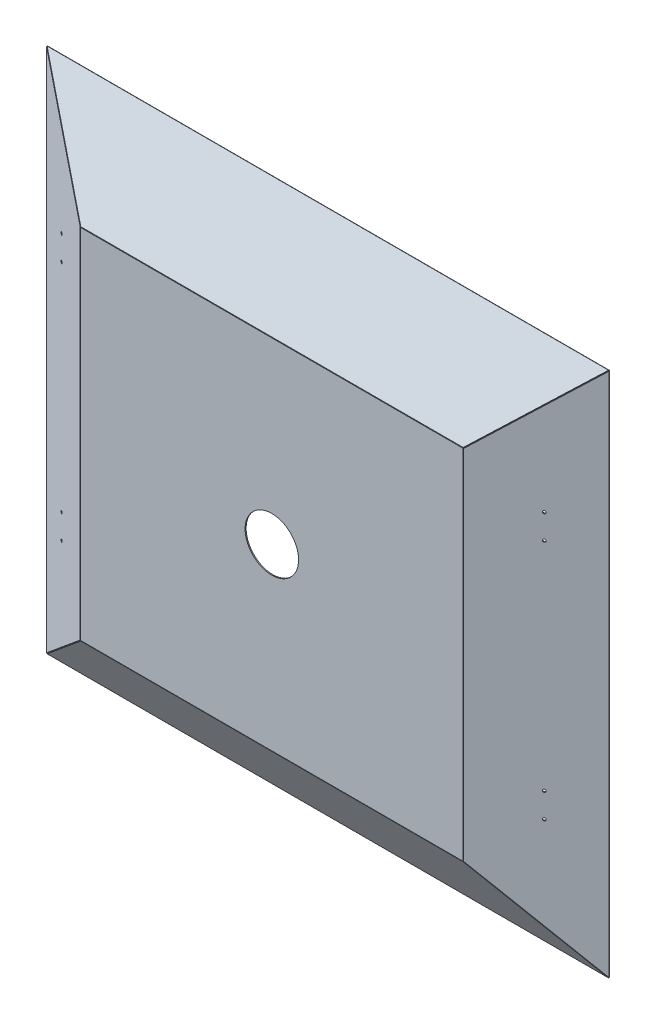
ISO-10303-21;
HEADER;
FILE_DESCRIPTION(('STEP AP214'),'2;1');
FILE_NAME('part.step','',(''),(''),'','','');
FILE_SCHEMA(('AUTOMOTIVE_DESIGN { 1 0 10303 214 1 1 1 1 }'));
ENDSEC;
DATA;
#1=APPLICATION_CONTEXT('core data for automotive mechanical design processes');
#2=APPLICATION_PROTOCOL_DEFINITION('international standard','automotive_design',2000,#1);
#3=PRODUCT_CONTEXT('',#1,'mechanical');
#4=PRODUCT('Part','Part','',(#3));
#5=PRODUCT_RELATED_PRODUCT_CATEGORY('part','',(#4));
#6=PRODUCT_DEFINITION_FORMATION('','',#4);
#7=PRODUCT_DEFINITION_CONTEXT('part definition',#1,'design');
#8=PRODUCT_DEFINITION('design','',#6,#7);
#9=PRODUCT_DEFINITION_SHAPE('','',#8);
#10=(LENGTH_UNIT() NAMED_UNIT(*) SI_UNIT(.MILLI.,.METRE.));
#11=(NAMED_UNIT(*) PLANE_ANGLE_UNIT() SI_UNIT($,.RADIAN.));
#12=(NAMED_UNIT(*) SI_UNIT($,.STERADIAN.) SOLID_ANGLE_UNIT());
#13=UNCERTAINTY_MEASURE_WITH_UNIT(LENGTH_MEASURE(1.E-05),#10,'distance_accuracy_value','');
#14=(GEOMETRIC_REPRESENTATION_CONTEXT(3) GLOBAL_UNCERTAINTY_ASSIGNED_CONTEXT((#13)) GLOBAL_UNIT_ASSIGNED_CONTEXT((#10,
#11,#12)) REPRESENTATION_CONTEXT('',''));
#15=CARTESIAN_POINT('',(0.,0.,0.));
#16=DIRECTION('',(0.,0.,1.));
#17=DIRECTION('',(1.,0.,0.));
#18=AXIS2_PLACEMENT_3D('',#15,#16,#17);
#19=CARTESIAN_POINT('',(-550.624060150376,-515.,103.));
#20=DIRECTION('',(1.,0.,0.));
#21=DIRECTION('',(0.,0.,-1.));
#22=AXIS2_PLACEMENT_3D('',#19,#20,#21);
#23=PLANE('',#22);
#24=DIRECTION('',(0.,-1.,0.));
#25=VECTOR('',#24,1.);
#26=CARTESIAN_POINT('',(-550.624060150376,-515.,100.));
#27=LINE('',#26,#25);
#28=CARTESIAN_POINT('',(-550.624060150376,515.,100.));
#29=VERTEX_POINT('',#28);
#30=CARTESIAN_POINT('',(-550.624060150376,-515.,100.));
#31=VERTEX_POINT('',#30);
#32=EDGE_CURVE('E118',#29,#31,#27,.T.);
#33=ORIENTED_EDGE('',*,*,#32,.T.);
#34=DIRECTION('',(0.,0.,-1.));
#35=VECTOR('',#34,1.);
#36=CARTESIAN_POINT('',(-550.624060150376,-515.,103.));
#37=LINE('',#36,#35);
#38=CARTESIAN_POINT('',(-550.624060150376,-515.,103.));
#39=VERTEX_POINT('',#38);
#40=EDGE_CURVE('E12',#39,#31,#37,.T.);
#41=ORIENTED_EDGE('',*,*,#40,.F.);
#42=DIRECTION('',(0.,-1.,0.));
#43=VECTOR('',#42,1.);
#44=CARTESIAN_POINT('',(-550.624060150376,-515.,103.));
#45=LINE('',#44,#43);
#46=CARTESIAN_POINT('',(-550.624060150376,515.,103.));
#47=VERTEX_POINT('',#46);
#48=EDGE_CURVE('E105',#47,#39,#45,.T.);
#49=ORIENTED_EDGE('',*,*,#48,.F.);
#50=DIRECTION('',(0.,0.,-1.));
#51=VECTOR('',#50,1.);
#52=CARTESIAN_POINT('',(-550.624060150376,515.,103.));
#53=LINE('',#52,#51);
#54=EDGE_CURVE('E114',#47,#29,#53,.T.);
#55=ORIENTED_EDGE('',*,*,#54,.T.);
#56=EDGE_LOOP('',(#33,#41,#49,#55));
#57=FACE_BOUND('',#56,.T.);
#58=ADVANCED_FACE('F53',(#57),#23,.F.);
#59=CARTESIAN_POINT('',(-550.624060150376,-515.,103.));
#60=DIRECTION('',(0.,1.,0.));
#61=DIRECTION('',(0.,0.,1.));
#62=AXIS2_PLACEMENT_3D('',#59,#60,#61);
#63=PLANE('',#62);
#64=DIRECTION('',(1.,0.,0.));
#65=VECTOR('',#64,1.);
#66=CARTESIAN_POINT('',(-550.624060150376,-515.,100.));
#67=LINE('',#66,#65);
#68=CARTESIAN_POINT('',(550.624060150375,-515.,100.));
#69=VERTEX_POINT('',#68);
#70=EDGE_CURVE('E109',#31,#69,#67,.T.);
#71=ORIENTED_EDGE('',*,*,#70,.T.);
#72=DIRECTION('',(0.,0.,-1.));
#73=VECTOR('',#72,1.);
#74=CARTESIAN_POINT('',(550.624060150375,-515.,103.));
#75=LINE('',#74,#73);
#76=CARTESIAN_POINT('',(550.624060150375,-515.,103.));
#77=VERTEX_POINT('',#76);
#78=EDGE_CURVE('E62',#77,#69,#75,.T.);
#79=ORIENTED_EDGE('',*,*,#78,.F.);
#80=DIRECTION('',(1.,0.,0.));
#81=VECTOR('',#80,1.);
#82=CARTESIAN_POINT('',(-550.624060150376,-515.,103.));
#83=LINE('',#82,#81);
#84=EDGE_CURVE('E100',#39,#77,#83,.T.);
#85=ORIENTED_EDGE('',*,*,#84,.F.);
#86=ORIENTED_EDGE('',*,*,#40,.T.);
#87=EDGE_LOOP('',(#71,#79,#85,#86));
#88=FACE_BOUND('',#87,.T.);
#89=ADVANCED_FACE('F108',(#88),#63,.F.);
#90=CARTESIAN_POINT('',(550.624060150375,-515.,103.));
#91=DIRECTION('',(-1.,0.,0.));
#92=DIRECTION('',(0.,0.,1.));
#93=AXIS2_PLACEMENT_3D('',#90,#91,#92);
#94=PLANE('',#93);
#95=DIRECTION('',(0.,1.,0.));
#96=VECTOR('',#95,1.);
#97=CARTESIAN_POINT('',(550.624060150375,-515.,100.));
#98=LINE('',#97,#96);
#99=CARTESIAN_POINT('',(550.624060150375,515.,100.));
#100=VERTEX_POINT('',#99);
#101=EDGE_CURVE('E87',#69,#100,#98,.T.);
#102=ORIENTED_EDGE('',*,*,#101,.T.);
#103=DIRECTION('',(0.,0.,-1.));
#104=VECTOR('',#103,1.);
#105=CARTESIAN_POINT('',(550.624060150375,515.,103.));
#106=LINE('',#105,#104);
#107=CARTESIAN_POINT('',(550.624060150375,515.,103.));
#108=VERTEX_POINT('',#107);
#109=EDGE_CURVE('E110',#108,#100,#106,.T.);
#110=ORIENTED_EDGE('',*,*,#109,.F.);
#111=DIRECTION('',(0.,1.,0.));
#112=VECTOR('',#111,1.);
#113=CARTESIAN_POINT('',(550.624060150375,-515.,103.));
#114=LINE('',#113,#112);
#115=EDGE_CURVE('E103',#77,#108,#114,.T.);
#116=ORIENTED_EDGE('',*,*,#115,.F.);
#117=ORIENTED_EDGE('',*,*,#78,.T.);
#118=EDGE_LOOP('',(#102,#110,#116,#117));
#119=FACE_BOUND('',#118,.T.);
#120=ADVANCED_FACE('F112',(#119),#94,.F.);
#121=CARTESIAN_POINT('',(-550.624060150376,515.,103.));
#122=DIRECTION('',(0.,-1.,0.));
#123=DIRECTION('',(0.,0.,-1.));
#124=AXIS2_PLACEMENT_3D('',#121,#122,#123);
#125=PLANE('',#124);
#126=DIRECTION('',(-1.,0.,0.));
#127=VECTOR('',#126,1.);
#128=CARTESIAN_POINT('',(-550.624060150376,515.,100.));
#129=LINE('',#128,#127);
#130=EDGE_CURVE('E93',#100,#29,#129,.T.);
#131=ORIENTED_EDGE('',*,*,#130,.T.);
#132=ORIENTED_EDGE('',*,*,#54,.F.);
#133=DIRECTION('',(-1.,0.,0.));
#134=VECTOR('',#133,1.);
#135=CARTESIAN_POINT('',(-550.624060150376,515.,103.));
#136=LINE('',#135,#134);
#137=EDGE_CURVE('E70',#108,#47,#136,.T.);
#138=ORIENTED_EDGE('',*,*,#137,.F.);
#139=ORIENTED_EDGE('',*,*,#109,.T.);
#140=EDGE_LOOP('',(#131,#132,#138,#139));
#141=FACE_BOUND('',#140,.T.);
#142=ADVANCED_FACE('F125',(#141),#125,.F.);
#143=CARTESIAN_POINT('',(0.,0.,103.));
#144=DIRECTION('',(0.,0.,-1.));
#145=DIRECTION('',(-1.,0.,0.));
#146=AXIS2_PLACEMENT_3D('',#143,#144,#145);
#147=PLANE('',#146);
#148=CARTESIAN_POINT('',(0.,0.,103.));
#149=DIRECTION('',(0.,0.,1.));
#150=DIRECTION('',(1.,0.,0.));
#151=AXIS2_PLACEMENT_3D('',#148,#149,#150);
#152=CIRCLE('',#151,77.);
#153=CARTESIAN_POINT('',(77.,0.,103.));
#154=VERTEX_POINT('',#153);
#155=EDGE_CURVE('E131',#154,#154,#152,.T.);
#156=ORIENTED_EDGE('',*,*,#155,.F.);
#157=EDGE_LOOP('',(#156));
#158=FACE_BOUND('',#157,.T.);
#159=ORIENTED_EDGE('',*,*,#48,.T.);
#160=ORIENTED_EDGE('',*,*,#84,.T.);
#161=ORIENTED_EDGE('',*,*,#115,.T.);
#162=ORIENTED_EDGE('',*,*,#137,.T.);
#163=EDGE_LOOP('',(#159,#160,#161,#162));
#164=FACE_BOUND('',#163,.T.);
#165=ADVANCED_FACE('F101',(#158,#164),#147,.F.);
#166=CARTESIAN_POINT('',(0.,0.,100.));
#167=DIRECTION('',(0.,0.,-1.));
#168=DIRECTION('',(-1.,0.,0.));
#169=AXIS2_PLACEMENT_3D('',#166,#167,#168);
#170=PLANE('',#169);
#171=CARTESIAN_POINT('',(0.,0.,100.));
#172=DIRECTION('',(0.,0.,-1.));
#173=DIRECTION('',(-1.,0.,0.));
#174=AXIS2_PLACEMENT_3D('',#171,#172,#173);
#175=CIRCLE('',#174,77.);
#176=CARTESIAN_POINT('',(-77.,0.,100.));
#177=VERTEX_POINT('',#176);
#178=EDGE_CURVE('E56',#177,#177,#175,.T.);
#179=ORIENTED_EDGE('',*,*,#178,.F.);
#180=EDGE_LOOP('',(#179));
#181=FACE_BOUND('',#180,.T.);
#182=ORIENTED_EDGE('',*,*,#32,.F.);
#183=ORIENTED_EDGE('',*,*,#130,.F.);
#184=ORIENTED_EDGE('',*,*,#101,.F.);
#185=ORIENTED_EDGE('',*,*,#70,.F.);
#186=EDGE_LOOP('',(#182,#183,#184,#185));
#187=FACE_BOUND('',#186,.T.);
#188=ADVANCED_FACE('F128',(#181,#187),#170,.T.);
#189=CARTESIAN_POINT('',(0.,0.,-60.8630569053166));
#190=DIRECTION('',(0.,0.,1.));
#191=DIRECTION('',(1.,0.,0.));
#192=AXIS2_PLACEMENT_3D('',#189,#190,#191);
#193=CYLINDRICAL_SURFACE('',#192,77.);
#194=ORIENTED_EDGE('',*,*,#178,.T.);
#195=EDGE_LOOP('',(#194));
#196=FACE_BOUND('',#195,.T.);
#197=ORIENTED_EDGE('',*,*,#155,.T.);
#198=EDGE_LOOP('',(#197));
#199=FACE_BOUND('',#198,.T.);
#200=ADVANCED_FACE('F138',(#196,#199),#193,.F.);
#201=CLOSED_SHELL('',(#58,#89,#120,#142,#165,#188,#200));
#202=MANIFOLD_SOLID_BREP('B2',#201);
#203=CARTESIAN_POINT('',(808.609699533113,757.95868594665,-58.3669060223027));
#204=DIRECTION('',(0.74714334267065,-0.55303299592244,0.368688663948294));
#205=DIRECTION('',(0.594945131002593,0.803766316224005,0.));
#206=AXIS2_PLACEMENT_3D('',#203,#204,#205);
#207=PLANE('',#206);
#208=DIRECTION('',(-0.664662941273942,-0.621660838181675,0.414440558787783));
#209=VECTOR('',#208,1.);
#210=CARTESIAN_POINT('',(808.609699533113,756.294585357975,-60.8630569053162));
#211=LINE('',#210,#209);
#212=CARTESIAN_POINT('',(808.609699533113,756.294585357975,-60.8630569053162));
#213=VERTEX_POINT('',#212);
#214=CARTESIAN_POINT('',(550.624060150375,515.,100.));
#215=VERTEX_POINT('',#214);
#216=EDGE_CURVE('E271',#213,#215,#211,.T.);
#217=ORIENTED_EDGE('',*,*,#216,.F.);
#218=DIRECTION('',(0.,-0.554700196225229,-0.832050294337844));
#219=VECTOR('',#218,1.);
#220=CARTESIAN_POINT('',(808.609699533113,757.95868594665,-58.3669060223027));
#221=LINE('',#220,#219);
#222=CARTESIAN_POINT('',(808.609699533113,757.95868594665,-58.3669060223027));
#223=VERTEX_POINT('',#222);
#224=EDGE_CURVE('E51',#223,#213,#221,.T.);
#225=ORIENTED_EDGE('',*,*,#224,.F.);
#226=DIRECTION('',(-0.664662941273942,-0.621660838181675,0.414440558787783));
#227=VECTOR('',#226,1.);
#228=CARTESIAN_POINT('',(808.609699533113,757.95868594665,-58.3669060223027));
#229=LINE('',#228,#227);
#230=CARTESIAN_POINT('',(550.624060150375,516.664100588676,102.496150883014));
#231=VERTEX_POINT('',#230);
#232=EDGE_CURVE('E265',#223,#231,#229,.T.);
#233=ORIENTED_EDGE('',*,*,#232,.T.);
#234=DIRECTION('',(0.,-0.554700196225229,-0.832050294337844));
#235=VECTOR('',#234,1.);
#236=CARTESIAN_POINT('',(550.624060150375,516.664100588676,102.496150883014));
#237=LINE('',#236,#235);
#238=EDGE_CURVE('E210',#231,#215,#237,.T.);
#239=ORIENTED_EDGE('',*,*,#238,.T.);
#240=EDGE_LOOP('',(#217,#225,#233,#239));
#241=FACE_BOUND('',#240,.T.);
#242=ADVANCED_FACE('F207',(#241),#207,.T.);
#243=CARTESIAN_POINT('',(-808.609699533113,757.95868594665,-58.3669060223028));
#244=DIRECTION('',(0.,0.832050294337844,-0.554700196225229));
#245=DIRECTION('',(0.,0.554700196225229,0.832050294337844));
#246=AXIS2_PLACEMENT_3D('',#243,#244,#245);
#247=PLANE('',#246);
#248=DIRECTION('',(1.,0.,0.));
#249=VECTOR('',#248,1.);
#250=CARTESIAN_POINT('',(-808.609699533113,756.294585357975,-60.8630569053163));
#251=LINE('',#250,#249);
#252=CARTESIAN_POINT('',(-808.609699533113,756.294585357975,-60.8630569053163));
#253=VERTEX_POINT('',#252);
#254=EDGE_CURVE('E267',#253,#213,#251,.T.);
#255=ORIENTED_EDGE('',*,*,#254,.F.);
#256=DIRECTION('',(0.,-0.554700196225229,-0.832050294337844));
#257=VECTOR('',#256,1.);
#258=CARTESIAN_POINT('',(-808.609699533113,757.95868594665,-58.3669060223028));
#259=LINE('',#258,#257);
#260=CARTESIAN_POINT('',(-808.609699533113,757.95868594665,-58.3669060223028));
#261=VERTEX_POINT('',#260);
#262=EDGE_CURVE('E216',#261,#253,#259,.T.);
#263=ORIENTED_EDGE('',*,*,#262,.F.);
#264=DIRECTION('',(1.,0.,0.));
#265=VECTOR('',#264,1.);
#266=CARTESIAN_POINT('',(-808.609699533113,757.95868594665,-58.3669060223028));
#267=LINE('',#266,#265);
#268=EDGE_CURVE('E262',#261,#223,#267,.T.);
#269=ORIENTED_EDGE('',*,*,#268,.T.);
#270=ORIENTED_EDGE('',*,*,#224,.T.);
#271=EDGE_LOOP('',(#255,#263,#269,#270));
#272=FACE_BOUND('',#271,.T.);
#273=ADVANCED_FACE('F281',(#272),#247,.T.);
#274=CARTESIAN_POINT('',(-550.624060150376,516.664100588676,102.496150883014));
#275=DIRECTION('',(-0.74714334267065,-0.55303299592244,0.368688663948293));
#276=DIRECTION('',(0.594945131002593,-0.803766316224005,0.));
#277=AXIS2_PLACEMENT_3D('',#274,#275,#276);
#278=PLANE('',#277);
#279=DIRECTION('',(-0.664662941273942,0.621660838181675,-0.414440558787783));
#280=VECTOR('',#279,1.);
#281=CARTESIAN_POINT('',(-550.624060150376,515.,100.));
#282=LINE('',#281,#280);
#283=CARTESIAN_POINT('',(-550.624060150376,515.,100.));
#284=VERTEX_POINT('',#283);
#285=EDGE_CURVE('E257',#284,#253,#282,.T.);
#286=ORIENTED_EDGE('',*,*,#285,.F.);
#287=DIRECTION('',(0.,-0.554700196225229,-0.832050294337844));
#288=VECTOR('',#287,1.);
#289=CARTESIAN_POINT('',(-550.624060150376,516.664100588676,102.496150883014));
#290=LINE('',#289,#288);
#291=CARTESIAN_POINT('',(-550.624060150376,516.664100588676,102.496150883014));
#292=VERTEX_POINT('',#291);
#293=EDGE_CURVE('E252',#292,#284,#290,.T.);
#294=ORIENTED_EDGE('',*,*,#293,.F.);
#295=DIRECTION('',(-0.664662941273942,0.621660838181675,-0.414440558787783));
#296=VECTOR('',#295,1.);
#297=CARTESIAN_POINT('',(-550.624060150376,516.664100588676,102.496150883014));
#298=LINE('',#297,#296);
#299=EDGE_CURVE('E255',#292,#261,#298,.T.);
#300=ORIENTED_EDGE('',*,*,#299,.T.);
#301=ORIENTED_EDGE('',*,*,#262,.T.);
#302=EDGE_LOOP('',(#286,#294,#300,#301));
#303=FACE_BOUND('',#302,.T.);
#304=ADVANCED_FACE('F254',(#303),#278,.T.);
#305=CARTESIAN_POINT('',(550.624060150375,516.664100588676,102.496150883014));
#306=DIRECTION('',(0.,-0.832050294337844,0.554700196225229));
#307=DIRECTION('',(0.,-0.554700196225229,-0.832050294337844));
#308=AXIS2_PLACEMENT_3D('',#305,#306,#307);
#309=PLANE('',#308);
#310=DIRECTION('',(-1.,0.,0.));
#311=VECTOR('',#310,1.);
#312=CARTESIAN_POINT('',(550.624060150375,515.,100.));
#313=LINE('',#312,#311);
#314=EDGE_CURVE('E274',#215,#284,#313,.T.);
#315=ORIENTED_EDGE('',*,*,#314,.F.);
#316=ORIENTED_EDGE('',*,*,#238,.F.);
#317=DIRECTION('',(-1.,0.,0.));
#318=VECTOR('',#317,1.);
#319=CARTESIAN_POINT('',(550.624060150375,516.664100588676,102.496150883014));
#320=LINE('',#319,#318);
#321=EDGE_CURVE('E261',#231,#292,#320,.T.);
#322=ORIENTED_EDGE('',*,*,#321,.T.);
#323=ORIENTED_EDGE('',*,*,#293,.T.);
#324=EDGE_LOOP('',(#315,#316,#322,#323));
#325=FACE_BOUND('',#324,.T.);
#326=ADVANCED_FACE('F264',(#325),#309,.T.);
#327=CARTESIAN_POINT('',(0.,206.27948520406,309.419227806091));
#328=DIRECTION('',(0.,-0.554700196225229,-0.832050294337844));
#329=DIRECTION('',(0.,0.832050294337844,-0.554700196225229));
#330=AXIS2_PLACEMENT_3D('',#327,#328,#329);
#331=PLANE('',#330);
#332=ORIENTED_EDGE('',*,*,#232,.F.);
#333=ORIENTED_EDGE('',*,*,#268,.F.);
#334=ORIENTED_EDGE('',*,*,#299,.F.);
#335=ORIENTED_EDGE('',*,*,#321,.F.);
#336=EDGE_LOOP('',(#332,#333,#334,#335));
#337=FACE_BOUND('',#336,.T.);
#338=ADVANCED_FACE('F260',(#337),#331,.F.);
#339=CARTESIAN_POINT('',(0.,204.615384615385,306.923076923077));
#340=DIRECTION('',(0.,-0.554700196225229,-0.832050294337844));
#341=DIRECTION('',(0.,0.832050294337844,-0.554700196225229));
#342=AXIS2_PLACEMENT_3D('',#339,#340,#341);
#343=PLANE('',#342);
#344=ORIENTED_EDGE('',*,*,#216,.T.);
#345=ORIENTED_EDGE('',*,*,#314,.T.);
#346=ORIENTED_EDGE('',*,*,#285,.T.);
#347=ORIENTED_EDGE('',*,*,#254,.T.);
#348=EDGE_LOOP('',(#344,#345,#346,#347));
#349=FACE_BOUND('',#348,.T.);
#350=ADVANCED_FACE('F280',(#349),#343,.T.);
#351=CLOSED_SHELL('',(#242,#273,#304,#326,#338,#350));
#352=MANIFOLD_SOLID_BREP('B6',#351);
#353=CARTESIAN_POINT('',(810.197013516392,756.294585357975,-58.3173871862668));
#354=DIRECTION('',(-0.848556573016445,0.,0.529104661093235));
#355=DIRECTION('',(0.529104661093235,0.,0.848556573016445));
#356=AXIS2_PLACEMENT_3D('',#353,#354,#355);
#357=PLANE('',#356);
#358=DIRECTION('',(0.,1.,0.));
#359=VECTOR('',#358,1.);
#360=CARTESIAN_POINT('',(808.609699533113,756.294585357975,-60.8630569053161));
#361=LINE('',#360,#359);
#362=CARTESIAN_POINT('',(808.609699533113,-756.294585357974,-60.8630569053162));
#363=VERTEX_POINT('',#362);
#364=CARTESIAN_POINT('',(808.609699533113,756.294585357975,-60.8630569053161));
#365=VERTEX_POINT('',#364);
#366=EDGE_CURVE('E403',#363,#365,#361,.T.);
#367=ORIENTED_EDGE('',*,*,#366,.T.);
#368=DIRECTION('',(-0.529104661093235,0.,-0.848556573016445));
#369=VECTOR('',#368,1.);
#370=CARTESIAN_POINT('',(810.197013516392,756.294585357975,-58.3173871862668));
#371=LINE('',#370,#369);
#372=CARTESIAN_POINT('',(810.197013516392,756.294585357975,-58.3173871862668));
#373=VERTEX_POINT('',#372);
#374=EDGE_CURVE('E205',#373,#365,#371,.T.);
#375=ORIENTED_EDGE('',*,*,#374,.F.);
#376=DIRECTION('',(0.,1.,0.));
#377=VECTOR('',#376,1.);
#378=CARTESIAN_POINT('',(810.197013516392,756.294585357975,-58.3173871862668));
#379=LINE('',#378,#377);
#380=CARTESIAN_POINT('',(810.197013516392,-756.294585357974,-58.3173871862669));
#381=VERTEX_POINT('',#380);
#382=EDGE_CURVE('E391',#381,#373,#379,.T.);
#383=ORIENTED_EDGE('',*,*,#382,.F.);
#384=DIRECTION('',(-0.529104661093235,0.,-0.848556573016445));
#385=VECTOR('',#384,1.);
#386=CARTESIAN_POINT('',(810.197013516392,-756.294585357974,-58.3173871862669));
#387=LINE('',#386,#385);
#388=EDGE_CURVE('E399',#381,#363,#387,.T.);
#389=ORIENTED_EDGE('',*,*,#388,.T.);
#390=EDGE_LOOP('',(#367,#375,#383,#389));
#391=FACE_BOUND('',#390,.T.);
#392=ADVANCED_FACE('F340',(#391),#357,.F.);
#393=CARTESIAN_POINT('',(552.211374133655,515.,102.54566971905));
#394=DIRECTION('',(0.527514390425972,-0.783286539059148,-0.328923647101051));
#395=DIRECTION('',(0.82943943686872,0.55859665284255,0.));
#396=AXIS2_PLACEMENT_3D('',#393,#394,#395);
#397=PLANE('',#396);
#398=DIRECTION('',(-0.664662941273942,-0.621660838181675,0.414440558787783));
#399=VECTOR('',#398,1.);
#400=CARTESIAN_POINT('',(550.624060150375,515.,100.));
#401=LINE('',#400,#399);
#402=CARTESIAN_POINT('',(550.624060150375,515.,100.));
#403=VERTEX_POINT('',#402);
#404=EDGE_CURVE('E395',#365,#403,#401,.T.);
#405=ORIENTED_EDGE('',*,*,#404,.T.);
#406=DIRECTION('',(-0.529104661093235,0.,-0.848556573016445));
#407=VECTOR('',#406,1.);
#408=CARTESIAN_POINT('',(552.211374133655,515.,102.54566971905));
#409=LINE('',#408,#407);
#410=CARTESIAN_POINT('',(552.211374133655,515.,102.54566971905));
#411=VERTEX_POINT('',#410);
#412=EDGE_CURVE('E348',#411,#403,#409,.T.);
#413=ORIENTED_EDGE('',*,*,#412,.F.);
#414=DIRECTION('',(-0.664662941273942,-0.621660838181675,0.414440558787783));
#415=VECTOR('',#414,1.);
#416=CARTESIAN_POINT('',(552.211374133655,515.,102.54566971905));
#417=LINE('',#416,#415);
#418=EDGE_CURVE('E386',#373,#411,#417,.T.);
#419=ORIENTED_EDGE('',*,*,#418,.F.);
#420=ORIENTED_EDGE('',*,*,#374,.T.);
#421=EDGE_LOOP('',(#405,#413,#419,#420));
#422=FACE_BOUND('',#421,.T.);
#423=ADVANCED_FACE('F394',(#422),#397,.F.);
#424=CARTESIAN_POINT('',(552.211374133655,-515.,102.54566971905));
#425=DIRECTION('',(0.848556573016445,0.,-0.529104661093235));
#426=DIRECTION('',(-0.529104661093235,0.,-0.848556573016445));
#427=AXIS2_PLACEMENT_3D('',#424,#425,#426);
#428=PLANE('',#427);
#429=DIRECTION('',(0.,-1.,0.));
#430=VECTOR('',#429,1.);
#431=CARTESIAN_POINT('',(550.624060150375,-515.,100.));
#432=LINE('',#431,#430);
#433=CARTESIAN_POINT('',(550.624060150375,-515.,100.));
#434=VERTEX_POINT('',#433);
#435=EDGE_CURVE('E373',#403,#434,#432,.T.);
#436=ORIENTED_EDGE('',*,*,#435,.T.);
#437=DIRECTION('',(-0.529104661093235,0.,-0.848556573016445));
#438=VECTOR('',#437,1.);
#439=CARTESIAN_POINT('',(552.211374133655,-515.,102.54566971905));
#440=LINE('',#439,#438);
#441=CARTESIAN_POINT('',(552.211374133655,-515.,102.54566971905));
#442=VERTEX_POINT('',#441);
#443=EDGE_CURVE('E396',#442,#434,#440,.T.);
#444=ORIENTED_EDGE('',*,*,#443,.F.);
#445=DIRECTION('',(0.,-1.,0.));
#446=VECTOR('',#445,1.);
#447=CARTESIAN_POINT('',(552.211374133655,-515.,102.54566971905));
#448=LINE('',#447,#446);
#449=EDGE_CURVE('E389',#411,#442,#448,.T.);
#450=ORIENTED_EDGE('',*,*,#449,.F.);
#451=ORIENTED_EDGE('',*,*,#412,.T.);
#452=EDGE_LOOP('',(#436,#444,#450,#451));
#453=FACE_BOUND('',#452,.T.);
#454=ADVANCED_FACE('F397',(#453),#428,.F.);
#455=CARTESIAN_POINT('',(810.197013516392,-756.294585357974,-58.3173871862669));
#456=DIRECTION('',(0.527514390425972,0.783286539059148,-0.328923647101051));
#457=DIRECTION('',(-0.82943943686872,0.55859665284255,0.));
#458=AXIS2_PLACEMENT_3D('',#455,#456,#457);
#459=PLANE('',#458);
#460=DIRECTION('',(0.664662941273942,-0.621660838181675,-0.414440558787783));
#461=VECTOR('',#460,1.);
#462=CARTESIAN_POINT('',(808.609699533113,-756.294585357974,-60.8630569053162));
#463=LINE('',#462,#461);
#464=EDGE_CURVE('E379',#434,#363,#463,.T.);
#465=ORIENTED_EDGE('',*,*,#464,.T.);
#466=ORIENTED_EDGE('',*,*,#388,.F.);
#467=DIRECTION('',(0.664662941273942,-0.621660838181675,-0.414440558787783));
#468=VECTOR('',#467,1.);
#469=CARTESIAN_POINT('',(810.197013516392,-756.294585357974,-58.3173871862669));
#470=LINE('',#469,#468);
#471=EDGE_CURVE('E356',#442,#381,#470,.T.);
#472=ORIENTED_EDGE('',*,*,#471,.F.);
#473=ORIENTED_EDGE('',*,*,#443,.T.);
#474=EDGE_LOOP('',(#465,#466,#472,#473));
#475=FACE_BOUND('',#474,.T.);
#476=ADVANCED_FACE('F411',(#475),#459,.F.);
#477=CARTESIAN_POINT('',(200.633002822987,0.,321.767063925889));
#478=DIRECTION('',(-0.529104661093235,0.,-0.848556573016445));
#479=DIRECTION('',(-0.848556573016445,0.,0.529104661093235));
#480=AXIS2_PLACEMENT_3D('',#477,#478,#479);
#481=PLANE('',#480);
#482=CARTESIAN_POINT('',(694.939180297106,383.,13.5498974746098));
#483=DIRECTION('',(-0.529104661093235,0.,-0.848556573016445));
#484=DIRECTION('',(-0.848556573016445,0.,0.529104661093235));
#485=AXIS2_PLACEMENT_3D('',#482,#483,#484);
#486=CIRCLE('',#485,4.00000000000002);
#487=CARTESIAN_POINT('',(691.544954005041,383.,15.6663161189827));
#488=VERTEX_POINT('',#487);
#489=EDGE_CURVE('E406',#488,#488,#486,.T.);
#490=ORIENTED_EDGE('',*,*,#489,.T.);
#491=EDGE_LOOP('',(#490));
#492=FACE_BOUND('',#491,.T.);
#493=CARTESIAN_POINT('',(694.939180297106,312.,13.5498974746098));
#494=DIRECTION('',(-0.529104661093235,0.,-0.848556573016445));
#495=DIRECTION('',(-0.848556573016445,0.,0.529104661093235));
#496=AXIS2_PLACEMENT_3D('',#493,#494,#495);
#497=CIRCLE('',#496,4.00000000000002);
#498=CARTESIAN_POINT('',(691.544954005041,312.,15.6663161189827));
#499=VERTEX_POINT('',#498);
#500=EDGE_CURVE('E419',#499,#499,#497,.T.);
#501=ORIENTED_EDGE('',*,*,#500,.T.);
#502=EDGE_LOOP('',(#501));
#503=FACE_BOUND('',#502,.T.);
#504=CARTESIAN_POINT('',(694.939180297106,-312.,13.5498974746098));
#505=DIRECTION('',(-0.529104661093235,0.,-0.848556573016445));
#506=DIRECTION('',(-0.848556573016445,0.,0.529104661093235));
#507=AXIS2_PLACEMENT_3D('',#504,#505,#506);
#508=CIRCLE('',#507,4.00000000000002);
#509=CARTESIAN_POINT('',(691.544954005041,-312.,15.6663161189827));
#510=VERTEX_POINT('',#509);
#511=EDGE_CURVE('E422',#510,#510,#508,.T.);
#512=ORIENTED_EDGE('',*,*,#511,.T.);
#513=EDGE_LOOP('',(#512));
#514=FACE_BOUND('',#513,.T.);
#515=CARTESIAN_POINT('',(694.939180297106,-383.,13.5498974746098));
#516=DIRECTION('',(-0.529104661093235,0.,-0.848556573016445));
#517=DIRECTION('',(-0.848556573016445,0.,0.529104661093235));
#518=AXIS2_PLACEMENT_3D('',#515,#516,#517);
#519=CIRCLE('',#518,4.00000000000002);
#520=CARTESIAN_POINT('',(691.544954005041,-383.,15.6663161189827));
#521=VERTEX_POINT('',#520);
#522=EDGE_CURVE('E425',#521,#521,#519,.T.);
#523=ORIENTED_EDGE('',*,*,#522,.T.);
#524=EDGE_LOOP('',(#523));
#525=FACE_BOUND('',#524,.T.);
#526=ORIENTED_EDGE('',*,*,#382,.T.);
#527=ORIENTED_EDGE('',*,*,#418,.T.);
#528=ORIENTED_EDGE('',*,*,#449,.T.);
#529=ORIENTED_EDGE('',*,*,#471,.T.);
#530=EDGE_LOOP('',(#526,#527,#528,#529));
#531=FACE_BOUND('',#530,.T.);
#532=ADVANCED_FACE('F387',(#492,#503,#514,#525,#531),#481,.F.);
#533=CARTESIAN_POINT('',(199.045688839707,0.,319.221394206839));
#534=DIRECTION('',(-0.529104661093235,0.,-0.848556573016445));
#535=DIRECTION('',(-0.848556573016445,0.,0.529104661093235));
#536=AXIS2_PLACEMENT_3D('',#533,#534,#535);
#537=PLANE('',#536);
#538=CARTESIAN_POINT('',(693.351866313827,383.,11.0042277555605));
#539=DIRECTION('',(-0.529104661093235,0.,-0.848556573016445));
#540=DIRECTION('',(-0.848556573016445,0.,0.529104661093235));
#541=AXIS2_PLACEMENT_3D('',#538,#539,#540);
#542=CIRCLE('',#541,4.00000000000002);
#543=CARTESIAN_POINT('',(689.957640021761,383.,13.1206463999335));
#544=VERTEX_POINT('',#543);
#545=EDGE_CURVE('E428',#544,#544,#542,.T.);
#546=ORIENTED_EDGE('',*,*,#545,.F.);
#547=EDGE_LOOP('',(#546));
#548=FACE_BOUND('',#547,.T.);
#549=CARTESIAN_POINT('',(693.351866313827,312.,11.0042277555604));
#550=DIRECTION('',(-0.529104661093235,0.,-0.848556573016445));
#551=DIRECTION('',(-0.848556573016445,0.,0.529104661093235));
#552=AXIS2_PLACEMENT_3D('',#549,#550,#551);
#553=CIRCLE('',#552,4.00000000000002);
#554=CARTESIAN_POINT('',(689.957640021761,312.,13.1206463999334));
#555=VERTEX_POINT('',#554);
#556=EDGE_CURVE('E435',#555,#555,#553,.T.);
#557=ORIENTED_EDGE('',*,*,#556,.F.);
#558=EDGE_LOOP('',(#557));
#559=FACE_BOUND('',#558,.T.);
#560=CARTESIAN_POINT('',(693.351866313827,-312.,11.0042277555604));
#561=DIRECTION('',(-0.529104661093235,0.,-0.848556573016445));
#562=DIRECTION('',(-0.848556573016445,0.,0.529104661093235));
#563=AXIS2_PLACEMENT_3D('',#560,#561,#562);
#564=CIRCLE('',#563,4.00000000000002);
#565=CARTESIAN_POINT('',(689.957640021761,-312.,13.1206463999334));
#566=VERTEX_POINT('',#565);
#567=EDGE_CURVE('E432',#566,#566,#564,.T.);
#568=ORIENTED_EDGE('',*,*,#567,.F.);
#569=EDGE_LOOP('',(#568));
#570=FACE_BOUND('',#569,.T.);
#571=CARTESIAN_POINT('',(693.351866313827,-383.,11.0042277555603));
#572=DIRECTION('',(-0.529104661093235,0.,-0.848556573016445));
#573=DIRECTION('',(-0.848556573016445,0.,0.529104661093235));
#574=AXIS2_PLACEMENT_3D('',#571,#572,#573);
#575=CIRCLE('',#574,4.00000000000002);
#576=CARTESIAN_POINT('',(689.957640021761,-383.,13.1206463999333));
#577=VERTEX_POINT('',#576);
#578=EDGE_CURVE('E429',#577,#577,#575,.T.);
#579=ORIENTED_EDGE('',*,*,#578,.F.);
#580=EDGE_LOOP('',(#579));
#581=FACE_BOUND('',#580,.T.);
#582=ORIENTED_EDGE('',*,*,#366,.F.);
#583=ORIENTED_EDGE('',*,*,#464,.F.);
#584=ORIENTED_EDGE('',*,*,#435,.F.);
#585=ORIENTED_EDGE('',*,*,#404,.F.);
#586=EDGE_LOOP('',(#582,#583,#584,#585));
#587=FACE_BOUND('',#586,.T.);
#588=ADVANCED_FACE('F414',(#548,#559,#570,#581,#587),#537,.T.);
#589=CARTESIAN_POINT('',(767.366692600066,-383.,129.706201040184));
#590=DIRECTION('',(-0.529104661093235,0.,-0.848556573016445));
#591=DIRECTION('',(-0.848556573016445,0.,0.529104661093235));
#592=AXIS2_PLACEMENT_3D('',#589,#590,#591);
#593=CYLINDRICAL_SURFACE('',#592,4.00000000000002);
#594=ORIENTED_EDGE('',*,*,#578,.T.);
#595=EDGE_LOOP('',(#594));
#596=FACE_BOUND('',#595,.T.);
#597=ORIENTED_EDGE('',*,*,#522,.F.);
#598=EDGE_LOOP('',(#597));
#599=FACE_BOUND('',#598,.T.);
#600=ADVANCED_FACE('F446',(#596,#599),#593,.F.);
#601=CARTESIAN_POINT('',(767.366692600066,-312.,129.706201040184));
#602=DIRECTION('',(-0.529104661093235,0.,-0.848556573016445));
#603=DIRECTION('',(-0.848556573016445,0.,0.529104661093235));
#604=AXIS2_PLACEMENT_3D('',#601,#602,#603);
#605=CYLINDRICAL_SURFACE('',#604,4.00000000000002);
#606=ORIENTED_EDGE('',*,*,#567,.T.);
#607=EDGE_LOOP('',(#606));
#608=FACE_BOUND('',#607,.T.);
#609=ORIENTED_EDGE('',*,*,#511,.F.);
#610=EDGE_LOOP('',(#609));
#611=FACE_BOUND('',#610,.T.);
#612=ADVANCED_FACE('F456',(#608,#611),#605,.F.);
#613=CARTESIAN_POINT('',(767.366692600066,312.,129.706201040184));
#614=DIRECTION('',(-0.529104661093235,0.,-0.848556573016445));
#615=DIRECTION('',(-0.848556573016445,0.,0.529104661093235));
#616=AXIS2_PLACEMENT_3D('',#613,#614,#615);
#617=CYLINDRICAL_SURFACE('',#616,4.00000000000002);
#618=ORIENTED_EDGE('',*,*,#556,.T.);
#619=EDGE_LOOP('',(#618));
#620=FACE_BOUND('',#619,.T.);
#621=ORIENTED_EDGE('',*,*,#500,.F.);
#622=EDGE_LOOP('',(#621));
#623=FACE_BOUND('',#622,.T.);
#624=ADVANCED_FACE('F507',(#620,#623),#617,.F.);
#625=CARTESIAN_POINT('',(767.366692600066,383.,129.706201040184));
#626=DIRECTION('',(-0.529104661093235,0.,-0.848556573016445));
#627=DIRECTION('',(-0.848556573016445,0.,0.529104661093235));
#628=AXIS2_PLACEMENT_3D('',#625,#626,#627);
#629=CYLINDRICAL_SURFACE('',#628,4.00000000000002);
#630=ORIENTED_EDGE('',*,*,#545,.T.);
#631=EDGE_LOOP('',(#630));
#632=FACE_BOUND('',#631,.T.);
#633=ORIENTED_EDGE('',*,*,#489,.F.);
#634=EDGE_LOOP('',(#633));
#635=FACE_BOUND('',#634,.T.);
#636=ADVANCED_FACE('F441',(#632,#635),#629,.F.);
#637=CLOSED_SHELL('',(#392,#423,#454,#476,#532,#588,#600,#612,#624,#636));
#638=MANIFOLD_SOLID_BREP('B45',#637);
#639=CARTESIAN_POINT('',(-552.211374133655,-515.,102.545669719049));
#640=DIRECTION('',(0.527514390425972,-0.783286539059148,0.328923647101051));
#641=DIRECTION('',(0.82943943686872,0.55859665284255,0.));
#642=AXIS2_PLACEMENT_3D('',#639,#640,#641);
#643=PLANE('',#642);
#644=DIRECTION('',(-0.664662941273942,-0.621660838181675,-0.414440558787783));
#645=VECTOR('',#644,1.);
#646=CARTESIAN_POINT('',(-550.624060150376,-515.,100.));
#647=LINE('',#646,#645);
#648=CARTESIAN_POINT('',(-550.624060150376,-515.,100.));
#649=VERTEX_POINT('',#648);
#650=CARTESIAN_POINT('',(-808.609699533113,-756.294585357974,-60.8630569053165));
#651=VERTEX_POINT('',#650);
#652=EDGE_CURVE('E621',#649,#651,#647,.T.);
#653=ORIENTED_EDGE('',*,*,#652,.F.);
#654=DIRECTION('',(0.529104661093235,0.,-0.848556573016445));
#655=VECTOR('',#654,1.);
#656=CARTESIAN_POINT('',(-552.211374133655,-515.,102.545669719049));
#657=LINE('',#656,#655);
#658=CARTESIAN_POINT('',(-552.211374133655,-515.,102.545669719049));
#659=VERTEX_POINT('',#658);
#660=EDGE_CURVE('E338',#659,#649,#657,.T.);
#661=ORIENTED_EDGE('',*,*,#660,.F.);
#662=DIRECTION('',(-0.664662941273942,-0.621660838181675,-0.414440558787783));
#663=VECTOR('',#662,1.);
#664=CARTESIAN_POINT('',(-552.211374133655,-515.,102.545669719049));
#665=LINE('',#664,#663);
#666=CARTESIAN_POINT('',(-810.197013516393,-756.294585357974,-58.3173871862671));
#667=VERTEX_POINT('',#666);
#668=EDGE_CURVE('E614',#659,#667,#665,.T.);
#669=ORIENTED_EDGE('',*,*,#668,.T.);
#670=DIRECTION('',(0.529104661093235,0.,-0.848556573016445));
#671=VECTOR('',#670,1.);
#672=CARTESIAN_POINT('',(-810.197013516393,-756.294585357974,-58.3173871862671));
#673=LINE('',#672,#671);
#674=EDGE_CURVE('E559',#667,#651,#673,.T.);
#675=ORIENTED_EDGE('',*,*,#674,.T.);
#676=EDGE_LOOP('',(#653,#661,#669,#675));
#677=FACE_BOUND('',#676,.T.);
#678=ADVANCED_FACE('F556',(#677),#643,.T.);
#679=CARTESIAN_POINT('',(-552.211374133655,-515.,102.545669719049));
#680=DIRECTION('',(0.848556573016445,0.,0.529104661093235));
#681=DIRECTION('',(0.529104661093235,0.,-0.848556573016445));
#682=AXIS2_PLACEMENT_3D('',#679,#680,#681);
#683=PLANE('',#682);
#684=DIRECTION('',(0.,-1.,0.));
#685=VECTOR('',#684,1.);
#686=CARTESIAN_POINT('',(-550.624060150376,-515.,100.));
#687=LINE('',#686,#685);
#688=CARTESIAN_POINT('',(-550.624060150376,515.,100.));
#689=VERTEX_POINT('',#688);
#690=EDGE_CURVE('E616',#689,#649,#687,.T.);
#691=ORIENTED_EDGE('',*,*,#690,.F.);
#692=DIRECTION('',(0.529104661093235,0.,-0.848556573016445));
#693=VECTOR('',#692,1.);
#694=CARTESIAN_POINT('',(-552.211374133655,515.,102.545669719049));
#695=LINE('',#694,#693);
#696=CARTESIAN_POINT('',(-552.211374133655,515.,102.545669719049));
#697=VERTEX_POINT('',#696);
#698=EDGE_CURVE('E565',#697,#689,#695,.T.);
#699=ORIENTED_EDGE('',*,*,#698,.F.);
#700=DIRECTION('',(0.,-1.,0.));
#701=VECTOR('',#700,1.);
#702=CARTESIAN_POINT('',(-552.211374133655,-515.,102.545669719049));
#703=LINE('',#702,#701);
#704=EDGE_CURVE('E611',#697,#659,#703,.T.);
#705=ORIENTED_EDGE('',*,*,#704,.T.);
#706=ORIENTED_EDGE('',*,*,#660,.T.);
#707=EDGE_LOOP('',(#691,#699,#705,#706));
#708=FACE_BOUND('',#707,.T.);
#709=ADVANCED_FACE('F632',(#708),#683,.T.);
#710=CARTESIAN_POINT('',(-810.197013516392,756.294585357975,-58.3173871862671));
#711=DIRECTION('',(0.527514390425973,0.783286539059147,0.328923647101051));
#712=DIRECTION('',(-0.82943943686872,0.55859665284255,0.));
#713=AXIS2_PLACEMENT_3D('',#710,#711,#712);
#714=PLANE('',#713);
#715=DIRECTION('',(0.664662941273942,-0.621660838181675,0.414440558787783));
#716=VECTOR('',#715,1.);
#717=CARTESIAN_POINT('',(-808.609699533113,756.294585357975,-60.8630569053165));
#718=LINE('',#717,#716);
#719=CARTESIAN_POINT('',(-808.609699533113,756.294585357975,-60.8630569053165));
#720=VERTEX_POINT('',#719);
#721=EDGE_CURVE('E606',#720,#689,#718,.T.);
#722=ORIENTED_EDGE('',*,*,#721,.F.);
#723=DIRECTION('',(0.529104661093235,0.,-0.848556573016445));
#724=VECTOR('',#723,1.);
#725=CARTESIAN_POINT('',(-810.197013516392,756.294585357975,-58.3173871862671));
#726=LINE('',#725,#724);
#727=CARTESIAN_POINT('',(-810.197013516392,756.294585357975,-58.3173871862671));
#728=VERTEX_POINT('',#727);
#729=EDGE_CURVE('E601',#728,#720,#726,.T.);
#730=ORIENTED_EDGE('',*,*,#729,.F.);
#731=DIRECTION('',(0.664662941273942,-0.621660838181675,0.414440558787783));
#732=VECTOR('',#731,1.);
#733=CARTESIAN_POINT('',(-810.197013516392,756.294585357975,-58.3173871862671));
#734=LINE('',#733,#732);
#735=EDGE_CURVE('E604',#728,#697,#734,.T.);
#736=ORIENTED_EDGE('',*,*,#735,.T.);
#737=ORIENTED_EDGE('',*,*,#698,.T.);
#738=EDGE_LOOP('',(#722,#730,#736,#737));
#739=FACE_BOUND('',#738,.T.);
#740=ADVANCED_FACE('F603',(#739),#714,.T.);
#741=CARTESIAN_POINT('',(-810.197013516393,-756.294585357974,-58.3173871862671));
#742=DIRECTION('',(-0.848556573016445,0.,-0.529104661093235));
#743=DIRECTION('',(-0.529104661093235,0.,0.848556573016445));
#744=AXIS2_PLACEMENT_3D('',#741,#742,#743);
#745=PLANE('',#744);
#746=DIRECTION('',(0.,1.,0.));
#747=VECTOR('',#746,1.);
#748=CARTESIAN_POINT('',(-808.609699533113,-756.294585357974,-60.8630569053165));
#749=LINE('',#748,#747);
#750=EDGE_CURVE('E624',#651,#720,#749,.T.);
#751=ORIENTED_EDGE('',*,*,#750,.F.);
#752=ORIENTED_EDGE('',*,*,#674,.F.);
#753=DIRECTION('',(0.,1.,0.));
#754=VECTOR('',#753,1.);
#755=CARTESIAN_POINT('',(-810.197013516393,-756.294585357974,-58.3173871862671));
#756=LINE('',#755,#754);
#757=EDGE_CURVE('E610',#667,#728,#756,.T.);
#758=ORIENTED_EDGE('',*,*,#757,.T.);
#759=ORIENTED_EDGE('',*,*,#729,.T.);
#760=EDGE_LOOP('',(#751,#752,#758,#759));
#761=FACE_BOUND('',#760,.T.);
#762=ADVANCED_FACE('F613',(#761),#745,.T.);
#763=CARTESIAN_POINT('',(-200.633002822987,0.,321.767063925889));
#764=DIRECTION('',(-0.529104661093235,0.,0.848556573016445));
#765=DIRECTION('',(0.848556573016445,0.,0.529104661093235));
#766=AXIS2_PLACEMENT_3D('',#763,#764,#765);
#767=PLANE('',#766);
#768=CARTESIAN_POINT('',(-694.939180297107,-383.,13.5498974746097));
#769=DIRECTION('',(-0.529104661093235,0.,0.848556573016445));
#770=DIRECTION('',(0.848556573016445,0.,0.529104661093235));
#771=AXIS2_PLACEMENT_3D('',#768,#769,#770);
#772=CIRCLE('',#771,3.99999999999999);
#773=CARTESIAN_POINT('',(-691.544954005041,-383.,15.6663161189826));
#774=VERTEX_POINT('',#773);
#775=EDGE_CURVE('E625',#774,#774,#772,.T.);
#776=ORIENTED_EDGE('',*,*,#775,.F.);
#777=EDGE_LOOP('',(#776));
#778=FACE_BOUND('',#777,.T.);
#779=CARTESIAN_POINT('',(-694.939180297107,-312.,13.5498974746097));
#780=DIRECTION('',(-0.529104661093235,0.,0.848556573016445));
#781=DIRECTION('',(0.848556573016445,0.,0.529104661093235));
#782=AXIS2_PLACEMENT_3D('',#779,#780,#781);
#783=CIRCLE('',#782,3.99999999999999);
#784=CARTESIAN_POINT('',(-691.544954005041,-312.,15.6663161189826));
#785=VERTEX_POINT('',#784);
#786=EDGE_CURVE('E693',#785,#785,#783,.T.);
#787=ORIENTED_EDGE('',*,*,#786,.F.);
#788=EDGE_LOOP('',(#787));
#789=FACE_BOUND('',#788,.T.);
#790=CARTESIAN_POINT('',(-694.939180297107,312.,13.5498974746096));
#791=DIRECTION('',(-0.529104661093235,0.,0.848556573016445));
#792=DIRECTION('',(0.848556573016445,0.,0.529104661093235));
#793=AXIS2_PLACEMENT_3D('',#790,#791,#792);
#794=CIRCLE('',#793,4.00000000000002);
#795=CARTESIAN_POINT('',(-691.544954005041,312.,15.6663161189825));
#796=VERTEX_POINT('',#795);
#797=EDGE_CURVE('E680',#796,#796,#794,.T.);
#798=ORIENTED_EDGE('',*,*,#797,.F.);
#799=EDGE_LOOP('',(#798));
#800=FACE_BOUND('',#799,.T.);
#801=CARTESIAN_POINT('',(-694.939180297107,383.,13.5498974746096));
#802=DIRECTION('',(-0.529104661093235,0.,0.848556573016445));
#803=DIRECTION('',(0.848556573016445,0.,0.529104661093235));
#804=AXIS2_PLACEMENT_3D('',#801,#802,#803);
#805=CIRCLE('',#804,4.00000000000002);
#806=CARTESIAN_POINT('',(-691.544954005041,383.,15.6663161189825));
#807=VERTEX_POINT('',#806);
#808=EDGE_CURVE('E676',#807,#807,#805,.T.);
#809=ORIENTED_EDGE('',*,*,#808,.F.);
#810=EDGE_LOOP('',(#809));
#811=FACE_BOUND('',#810,.T.);
#812=ORIENTED_EDGE('',*,*,#668,.F.);
#813=ORIENTED_EDGE('',*,*,#704,.F.);
#814=ORIENTED_EDGE('',*,*,#735,.F.);
#815=ORIENTED_EDGE('',*,*,#757,.F.);
#816=EDGE_LOOP('',(#812,#813,#814,#815));
#817=FACE_BOUND('',#816,.T.);
#818=ADVANCED_FACE('F609',(#778,#789,#800,#811,#817),#767,.T.);
#819=CARTESIAN_POINT('',(-199.045688839707,0.,319.221394206839));
#820=DIRECTION('',(-0.529104661093235,0.,0.848556573016445));
#821=DIRECTION('',(0.848556573016445,0.,0.529104661093235));
#822=AXIS2_PLACEMENT_3D('',#819,#820,#821);
#823=PLANE('',#822);
#824=CARTESIAN_POINT('',(-693.351866313827,-383.,11.0042277555603));
#825=DIRECTION('',(0.529104661093235,0.,-0.848556573016445));
#826=DIRECTION('',(-0.848556573016445,0.,-0.529104661093235));
#827=AXIS2_PLACEMENT_3D('',#824,#825,#826);
#828=CIRCLE('',#827,3.99999999999999);
#829=CARTESIAN_POINT('',(-696.746092605893,-383.,8.88780911118738));
#830=VERTEX_POINT('',#829);
#831=EDGE_CURVE('E675',#830,#830,#828,.T.);
#832=ORIENTED_EDGE('',*,*,#831,.F.);
#833=EDGE_LOOP('',(#832));
#834=FACE_BOUND('',#833,.T.);
#835=CARTESIAN_POINT('',(-693.351866313827,-312.,11.0042277555603));
#836=DIRECTION('',(0.529104661093235,0.,-0.848556573016445));
#837=DIRECTION('',(-0.848556573016445,0.,-0.529104661093235));
#838=AXIS2_PLACEMENT_3D('',#835,#836,#837);
#839=CIRCLE('',#838,3.99999999999999);
#840=CARTESIAN_POINT('',(-696.746092605893,-312.,8.88780911118738));
#841=VERTEX_POINT('',#840);
#842=EDGE_CURVE('E677',#841,#841,#839,.T.);
#843=ORIENTED_EDGE('',*,*,#842,.F.);
#844=EDGE_LOOP('',(#843));
#845=FACE_BOUND('',#844,.T.);
#846=CARTESIAN_POINT('',(-693.351866313827,312.,11.0042277555603));
#847=DIRECTION('',(0.529104661093235,0.,-0.848556573016445));
#848=DIRECTION('',(-0.848556573016445,0.,-0.529104661093235));
#849=AXIS2_PLACEMENT_3D('',#846,#847,#848);
#850=CIRCLE('',#849,4.00000000000002);
#851=CARTESIAN_POINT('',(-696.746092605893,312.,8.88780911118736));
#852=VERTEX_POINT('',#851);
#853=EDGE_CURVE('E683',#852,#852,#850,.T.);
#854=ORIENTED_EDGE('',*,*,#853,.F.);
#855=EDGE_LOOP('',(#854));
#856=FACE_BOUND('',#855,.T.);
#857=CARTESIAN_POINT('',(-693.351866313827,383.,11.0042277555603));
#858=DIRECTION('',(0.529104661093235,0.,-0.848556573016445));
#859=DIRECTION('',(-0.848556573016445,0.,-0.529104661093235));
#860=AXIS2_PLACEMENT_3D('',#857,#858,#859);
#861=CIRCLE('',#860,4.00000000000002);
#862=CARTESIAN_POINT('',(-696.746092605893,383.,8.88780911118736));
#863=VERTEX_POINT('',#862);
#864=EDGE_CURVE('E688',#863,#863,#861,.T.);
#865=ORIENTED_EDGE('',*,*,#864,.F.);
#866=EDGE_LOOP('',(#865));
#867=FACE_BOUND('',#866,.T.);
#868=ORIENTED_EDGE('',*,*,#652,.T.);
#869=ORIENTED_EDGE('',*,*,#750,.T.);
#870=ORIENTED_EDGE('',*,*,#721,.T.);
#871=ORIENTED_EDGE('',*,*,#690,.T.);
#872=EDGE_LOOP('',(#868,#869,#870,#871));
#873=FACE_BOUND('',#872,.T.);
#874=ADVANCED_FACE('F631',(#834,#845,#856,#867,#873),#823,.F.);
#875=CARTESIAN_POINT('',(-767.366692600067,383.,129.706201040184));
#876=DIRECTION('',(0.529104661093235,0.,-0.848556573016445));
#877=DIRECTION('',(-0.848556573016445,0.,-0.529104661093235));
#878=AXIS2_PLACEMENT_3D('',#875,#876,#877);
#879=CYLINDRICAL_SURFACE('',#878,4.00000000000002);
#880=ORIENTED_EDGE('',*,*,#808,.T.);
#881=EDGE_LOOP('',(#880));
#882=FACE_BOUND('',#881,.T.);
#883=ORIENTED_EDGE('',*,*,#864,.T.);
#884=EDGE_LOOP('',(#883));
#885=FACE_BOUND('',#884,.T.);
#886=ADVANCED_FACE('F650',(#882,#885),#879,.F.);
#887=CARTESIAN_POINT('',(-767.366692600067,312.,129.706201040184));
#888=DIRECTION('',(0.529104661093235,0.,-0.848556573016445));
#889=DIRECTION('',(-0.848556573016445,0.,-0.529104661093235));
#890=AXIS2_PLACEMENT_3D('',#887,#888,#889);
#891=CYLINDRICAL_SURFACE('',#890,4.00000000000002);
#892=ORIENTED_EDGE('',*,*,#797,.T.);
#893=EDGE_LOOP('',(#892));
#894=FACE_BOUND('',#893,.T.);
#895=ORIENTED_EDGE('',*,*,#853,.T.);
#896=EDGE_LOOP('',(#895));
#897=FACE_BOUND('',#896,.T.);
#898=ADVANCED_FACE('F657',(#894,#897),#891,.F.);
#899=CARTESIAN_POINT('',(-767.366692600067,-312.,129.706201040184));
#900=DIRECTION('',(0.529104661093235,0.,-0.848556573016445));
#901=DIRECTION('',(-0.848556573016445,0.,-0.529104661093235));
#902=AXIS2_PLACEMENT_3D('',#899,#900,#901);
#903=CYLINDRICAL_SURFACE('',#902,3.99999999999999);
#904=ORIENTED_EDGE('',*,*,#786,.T.);
#905=EDGE_LOOP('',(#904));
#906=FACE_BOUND('',#905,.T.);
#907=ORIENTED_EDGE('',*,*,#842,.T.);
#908=EDGE_LOOP('',(#907));
#909=FACE_BOUND('',#908,.T.);
#910=ADVANCED_FACE('F661',(#906,#909),#903,.F.);
#911=CARTESIAN_POINT('',(-767.366692600067,-383.,129.706201040184));
#912=DIRECTION('',(0.529104661093235,0.,-0.848556573016445));
#913=DIRECTION('',(-0.848556573016445,0.,-0.529104661093235));
#914=AXIS2_PLACEMENT_3D('',#911,#912,#913);
#915=CYLINDRICAL_SURFACE('',#914,3.99999999999999);
#916=ORIENTED_EDGE('',*,*,#775,.T.);
#917=EDGE_LOOP('',(#916));
#918=FACE_BOUND('',#917,.T.);
#919=ORIENTED_EDGE('',*,*,#831,.T.);
#920=EDGE_LOOP('',(#919));
#921=FACE_BOUND('',#920,.T.);
#922=ADVANCED_FACE('F665',(#918,#921),#915,.F.);
#923=CLOSED_SHELL('',(#678,#709,#740,#762,#818,#874,#886,#898,#910,#922));
#924=MANIFOLD_SOLID_BREP('B199',#923);
#925=CARTESIAN_POINT('',(-808.609699533113,-757.95868594665,-58.366906022303));
#926=DIRECTION('',(0.,0.832050294337844,0.554700196225229));
#927=DIRECTION('',(0.,-0.554700196225229,0.832050294337844));
#928=AXIS2_PLACEMENT_3D('',#925,#926,#927);
#929=PLANE('',#928);
#930=DIRECTION('',(1.,0.,0.));
#931=VECTOR('',#930,1.);
#932=CARTESIAN_POINT('',(-808.609699533113,-756.294585357974,-60.8630569053166));
#933=LINE('',#932,#931);
#934=CARTESIAN_POINT('',(-808.609699533113,-756.294585357974,-60.8630569053166));
#935=VERTEX_POINT('',#934);
#936=CARTESIAN_POINT('',(808.609699533112,-756.294585357974,-60.8630569053166));
#937=VERTEX_POINT('',#936);
#938=EDGE_CURVE('E817',#935,#937,#933,.T.);
#939=ORIENTED_EDGE('',*,*,#938,.T.);
#940=DIRECTION('',(0.,0.554700196225229,-0.832050294337844));
#941=VECTOR('',#940,1.);
#942=CARTESIAN_POINT('',(808.609699533112,-757.95868594665,-58.366906022303));
#943=LINE('',#942,#941);
#944=CARTESIAN_POINT('',(808.609699533112,-757.95868594665,-58.366906022303));
#945=VERTEX_POINT('',#944);
#946=EDGE_CURVE('E771',#945,#937,#943,.T.);
#947=ORIENTED_EDGE('',*,*,#946,.F.);
#948=DIRECTION('',(1.,0.,0.));
#949=VECTOR('',#948,1.);
#950=CARTESIAN_POINT('',(-808.609699533113,-757.95868594665,-58.366906022303));
#951=LINE('',#950,#949);
#952=CARTESIAN_POINT('',(-808.609699533113,-757.95868594665,-58.366906022303));
#953=VERTEX_POINT('',#952);
#954=EDGE_CURVE('E809',#953,#945,#951,.T.);
#955=ORIENTED_EDGE('',*,*,#954,.F.);
#956=DIRECTION('',(0.,0.554700196225229,-0.832050294337844));
#957=VECTOR('',#956,1.);
#958=CARTESIAN_POINT('',(-808.609699533113,-757.95868594665,-58.366906022303));
#959=LINE('',#958,#957);
#960=EDGE_CURVE('E554',#953,#935,#959,.T.);
#961=ORIENTED_EDGE('',*,*,#960,.T.);
#962=EDGE_LOOP('',(#939,#947,#955,#961));
#963=FACE_BOUND('',#962,.T.);
#964=ADVANCED_FACE('F763',(#963),#929,.F.);
#965=CARTESIAN_POINT('',(550.624060150375,-516.664100588675,102.496150883013));
#966=DIRECTION('',(-0.74714334267065,-0.55303299592244,-0.368688663948293));
#967=DIRECTION('',(0.594945131002593,-0.803766316224005,0.));
#968=AXIS2_PLACEMENT_3D('',#965,#966,#967);
#969=PLANE('',#968);
#970=DIRECTION('',(-0.664662941273942,0.621660838181675,0.414440558787783));
#971=VECTOR('',#970,1.);
#972=CARTESIAN_POINT('',(550.624060150375,-515.,99.9999999999999));
#973=LINE('',#972,#971);
#974=CARTESIAN_POINT('',(550.624060150375,-515.,99.9999999999999));
#975=VERTEX_POINT('',#974);
#976=EDGE_CURVE('E796',#937,#975,#973,.T.);
#977=ORIENTED_EDGE('',*,*,#976,.T.);
#978=DIRECTION('',(0.,0.554700196225229,-0.832050294337844));
#979=VECTOR('',#978,1.);
#980=CARTESIAN_POINT('',(550.624060150375,-516.664100588675,102.496150883013));
#981=LINE('',#980,#979);
#982=CARTESIAN_POINT('',(550.624060150375,-516.664100588675,102.496150883013));
#983=VERTEX_POINT('',#982);
#984=EDGE_CURVE('E818',#983,#975,#981,.T.);
#985=ORIENTED_EDGE('',*,*,#984,.F.);
#986=DIRECTION('',(-0.664662941273942,0.621660838181675,0.414440558787783));
#987=VECTOR('',#986,1.);
#988=CARTESIAN_POINT('',(808.609699533112,-757.95868594665,-58.366906022303));
#989=LINE('',#988,#987);
#990=EDGE_CURVE('E813',#945,#983,#989,.T.);
#991=ORIENTED_EDGE('',*,*,#990,.F.);
#992=ORIENTED_EDGE('',*,*,#946,.T.);
#993=EDGE_LOOP('',(#977,#985,#991,#992));
#994=FACE_BOUND('',#993,.T.);
#995=ADVANCED_FACE('F819',(#994),#969,.F.);
#996=CARTESIAN_POINT('',(-550.624060150376,-516.664100588675,102.496150883013));
#997=DIRECTION('',(0.,-0.832050294337844,-0.554700196225229));
#998=DIRECTION('',(0.,0.554700196225229,-0.832050294337844));
#999=AXIS2_PLACEMENT_3D('',#996,#997,#998);
#1000=PLANE('',#999);
#1001=DIRECTION('',(-1.,0.,0.));
#1002=VECTOR('',#1001,1.);
#1003=CARTESIAN_POINT('',(-550.624060150376,-515.,99.9999999999999));
#1004=LINE('',#1003,#1002);
#1005=CARTESIAN_POINT('',(-550.624060150376,-515.,99.9999999999999));
#1006=VERTEX_POINT('',#1005);
#1007=EDGE_CURVE('E803',#975,#1006,#1004,.T.);
#1008=ORIENTED_EDGE('',*,*,#1007,.T.);
#1009=DIRECTION('',(0.,0.554700196225229,-0.832050294337844));
#1010=VECTOR('',#1009,1.);
#1011=CARTESIAN_POINT('',(-550.624060150376,-516.664100588675,102.496150883013));
#1012=LINE('',#1011,#1010);
#1013=CARTESIAN_POINT('',(-550.624060150376,-516.664100588675,102.496150883013));
#1014=VERTEX_POINT('',#1013);
#1015=EDGE_CURVE('E823',#1014,#1006,#1012,.T.);
#1016=ORIENTED_EDGE('',*,*,#1015,.F.);
#1017=DIRECTION('',(-1.,0.,0.));
#1018=VECTOR('',#1017,1.);
#1019=CARTESIAN_POINT('',(-550.624060150376,-516.664100588675,102.496150883013));
#1020=LINE('',#1019,#1018);
#1021=EDGE_CURVE('E821',#983,#1014,#1020,.T.);
#1022=ORIENTED_EDGE('',*,*,#1021,.F.);
#1023=ORIENTED_EDGE('',*,*,#984,.T.);
#1024=EDGE_LOOP('',(#1008,#1016,#1022,#1023));
#1025=FACE_BOUND('',#1024,.T.);
#1026=ADVANCED_FACE('F833',(#1025),#1000,.F.);
#1027=CARTESIAN_POINT('',(-550.624060150376,-516.664100588675,102.496150883013));
#1028=DIRECTION('',(0.74714334267065,-0.55303299592244,-0.368688663948293));
#1029=DIRECTION('',(0.594945131002593,0.803766316224006,0.));
#1030=AXIS2_PLACEMENT_3D('',#1027,#1028,#1029);
#1031=PLANE('',#1030);
#1032=DIRECTION('',(-0.664662941273942,-0.621660838181675,-0.414440558787783));
#1033=VECTOR('',#1032,1.);
#1034=CARTESIAN_POINT('',(-550.624060150376,-515.,99.9999999999999));
#1035=LINE('',#1034,#1033);
#1036=EDGE_CURVE('E830',#1006,#935,#1035,.T.);
#1037=ORIENTED_EDGE('',*,*,#1036,.T.);
#1038=ORIENTED_EDGE('',*,*,#960,.F.);
#1039=DIRECTION('',(-0.664662941273941,-0.621660838181675,-0.414440558787783));
#1040=VECTOR('',#1039,1.);
#1041=CARTESIAN_POINT('',(-711.,-666.664100588676,2.49615088301336));
#1042=LINE('',#1041,#1040);
#1043=EDGE_CURVE('E779',#1014,#953,#1042,.T.);
#1044=ORIENTED_EDGE('',*,*,#1043,.F.);
#1045=ORIENTED_EDGE('',*,*,#1015,.T.);
#1046=EDGE_LOOP('',(#1037,#1038,#1044,#1045));
#1047=FACE_BOUND('',#1046,.T.);
#1048=ADVANCED_FACE('F837',(#1047),#1031,.F.);
#1049=CARTESIAN_POINT('',(0.,-206.27948520406,309.41922780609));
#1050=DIRECTION('',(0.,0.554700196225229,-0.832050294337844));
#1051=DIRECTION('',(0.,0.832050294337844,0.554700196225229));
#1052=AXIS2_PLACEMENT_3D('',#1049,#1050,#1051);
#1053=PLANE('',#1052);
#1054=ORIENTED_EDGE('',*,*,#1043,.T.);
#1055=ORIENTED_EDGE('',*,*,#954,.T.);
#1056=ORIENTED_EDGE('',*,*,#990,.T.);
#1057=ORIENTED_EDGE('',*,*,#1021,.T.);
#1058=EDGE_LOOP('',(#1054,#1055,#1056,#1057));
#1059=FACE_BOUND('',#1058,.T.);
#1060=ADVANCED_FACE('F811',(#1059),#1053,.F.);
#1061=CARTESIAN_POINT('',(0.,-204.615384615384,306.923076923077));
#1062=DIRECTION('',(0.,0.554700196225229,-0.832050294337844));
#1063=DIRECTION('',(0.,0.832050294337844,0.554700196225229));
#1064=AXIS2_PLACEMENT_3D('',#1061,#1062,#1063);
#1065=PLANE('',#1064);
#1066=ORIENTED_EDGE('',*,*,#938,.F.);
#1067=ORIENTED_EDGE('',*,*,#1036,.F.);
#1068=ORIENTED_EDGE('',*,*,#1007,.F.);
#1069=ORIENTED_EDGE('',*,*,#976,.F.);
#1070=EDGE_LOOP('',(#1066,#1067,#1068,#1069));
#1071=FACE_BOUND('',#1070,.T.);
#1072=ADVANCED_FACE('F836',(#1071),#1065,.T.);
#1073=CLOSED_SHELL('',(#964,#995,#1026,#1048,#1060,#1072));
#1074=MANIFOLD_SOLID_BREP('B332',#1073);
#1075=ADVANCED_BREP_SHAPE_REPRESENTATION('',(#18,#202,#352,#638,#924,#1074),#14);
#1076=SHAPE_DEFINITION_REPRESENTATION(#9,#1075);
ENDSEC;
END-ISO-10303-21;
